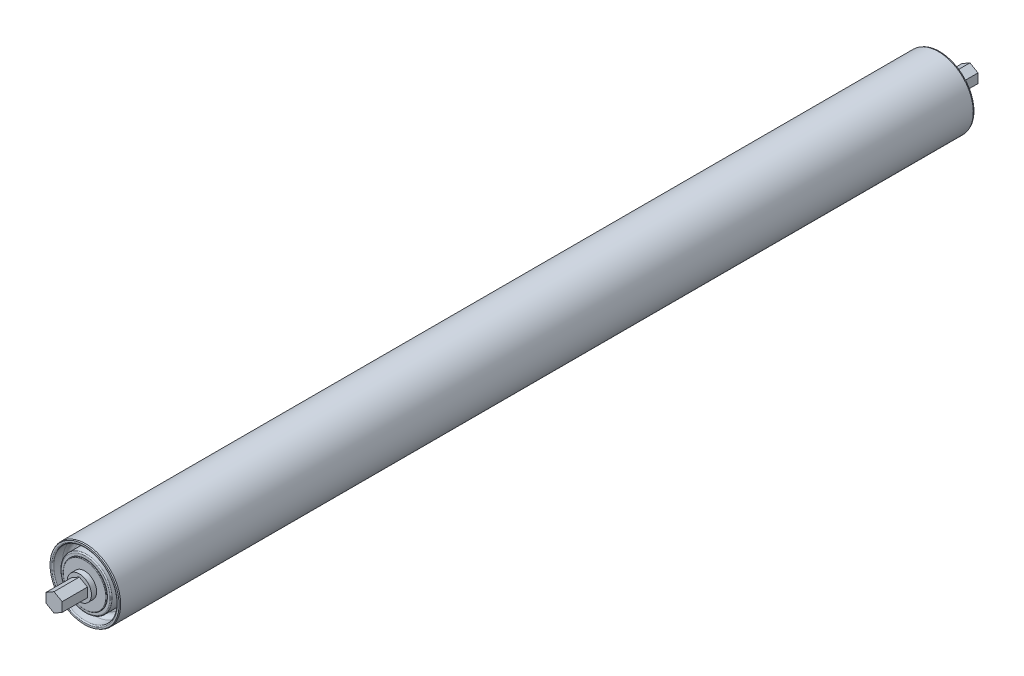
ISO-10303-21;
HEADER;
FILE_DESCRIPTION(('STEP AP214'),'2;1');
FILE_NAME('part.step','',(''),(''),'','','');
FILE_SCHEMA(('AUTOMOTIVE_DESIGN { 1 0 10303 214 1 1 1 1 }'));
ENDSEC;
DATA;
#1=APPLICATION_CONTEXT('core data for automotive mechanical design processes');
#2=APPLICATION_PROTOCOL_DEFINITION('international standard','automotive_design',2000,#1);
#3=PRODUCT_CONTEXT('',#1,'mechanical');
#4=PRODUCT('Part','Part','',(#3));
#5=PRODUCT_RELATED_PRODUCT_CATEGORY('part','',(#4));
#6=PRODUCT_DEFINITION_FORMATION('','',#4);
#7=PRODUCT_DEFINITION_CONTEXT('part definition',#1,'design');
#8=PRODUCT_DEFINITION('design','',#6,#7);
#9=PRODUCT_DEFINITION_SHAPE('','',#8);
#10=(LENGTH_UNIT() NAMED_UNIT(*) SI_UNIT(.MILLI.,.METRE.));
#11=(NAMED_UNIT(*) PLANE_ANGLE_UNIT() SI_UNIT($,.RADIAN.));
#12=(NAMED_UNIT(*) SI_UNIT($,.STERADIAN.) SOLID_ANGLE_UNIT());
#13=UNCERTAINTY_MEASURE_WITH_UNIT(LENGTH_MEASURE(1.E-05),#10,'distance_accuracy_value','');
#14=(GEOMETRIC_REPRESENTATION_CONTEXT(3) GLOBAL_UNCERTAINTY_ASSIGNED_CONTEXT((#13)) GLOBAL_UNIT_ASSIGNED_CONTEXT((#10,
#11,#12)) REPRESENTATION_CONTEXT('',''));
#15=CARTESIAN_POINT('',(0.,0.,0.));
#16=DIRECTION('',(0.,0.,1.));
#17=DIRECTION('',(1.,0.,0.));
#18=AXIS2_PLACEMENT_3D('',#15,#16,#17);
#19=CARTESIAN_POINT('',(0.,23.8125000000001,-294.878125));
#20=DIRECTION('',(0.,0.,1.));
#21=DIRECTION('',(0.,-1.,0.));
#22=AXIS2_PLACEMENT_3D('',#19,#20,#21);
#23=PLANE('',#22);
#24=CARTESIAN_POINT('',(0.,0.,-294.878125));
#25=DIRECTION('',(0.,0.,1.));
#26=DIRECTION('',(0.,-1.,0.));
#27=AXIS2_PLACEMENT_3D('',#24,#25,#26);
#28=CIRCLE('',#27,22.733);
#29=CARTESIAN_POINT('',(0.,-22.733,-294.878125));
#30=VERTEX_POINT('',#29);
#31=EDGE_CURVE('E305',#30,#30,#28,.T.);
#32=ORIENTED_EDGE('',*,*,#31,.T.);
#33=EDGE_LOOP('',(#32));
#34=FACE_BOUND('',#33,.T.);
#35=CARTESIAN_POINT('',(0.,0.,-294.878125));
#36=DIRECTION('',(0.,0.,1.));
#37=DIRECTION('',(0.,-1.,0.));
#38=AXIS2_PLACEMENT_3D('',#35,#36,#37);
#39=CIRCLE('',#38,23.8125);
#40=CARTESIAN_POINT('',(0.,-23.8124999999999,-294.878125));
#41=VERTEX_POINT('',#40);
#42=EDGE_CURVE('E223',#41,#41,#39,.T.);
#43=ORIENTED_EDGE('',*,*,#42,.F.);
#44=EDGE_LOOP('',(#43));
#45=FACE_BOUND('',#44,.T.);
#46=ADVANCED_FACE('F41',(#34,#45),#23,.F.);
#47=CARTESIAN_POINT('',(0.,0.,-294.878125));
#48=DIRECTION('',(0.,0.,1.));
#49=DIRECTION('',(0.,-1.,0.));
#50=AXIS2_PLACEMENT_3D('',#47,#48,#49);
#51=CONICAL_SURFACE('',#50,23.8125,0.380506377112395);
#52=CARTESIAN_POINT('',(0.,0.,-294.084375));
#53=DIRECTION('',(0.,0.,1.));
#54=DIRECTION('',(0.,-1.,0.));
#55=AXIS2_PLACEMENT_3D('',#52,#53,#54);
#56=CIRCLE('',#55,24.13);
#57=CARTESIAN_POINT('',(0.,-24.1299999999999,-294.084375));
#58=VERTEX_POINT('',#57);
#59=EDGE_CURVE('E220',#58,#58,#56,.T.);
#60=ORIENTED_EDGE('',*,*,#59,.F.);
#61=EDGE_LOOP('',(#60));
#62=FACE_BOUND('',#61,.T.);
#63=ORIENTED_EDGE('',*,*,#42,.T.);
#64=EDGE_LOOP('',(#63));
#65=FACE_BOUND('',#64,.T.);
#66=ADVANCED_FACE('F391',(#62,#65),#51,.T.);
#67=CARTESIAN_POINT('',(0.,0.,315.9125));
#68=DIRECTION('',(0.,0.,1.));
#69=DIRECTION('',(0.,-1.,0.));
#70=AXIS2_PLACEMENT_3D('',#67,#68,#69);
#71=CYLINDRICAL_SURFACE('',#70,24.13);
#72=CARTESIAN_POINT('',(0.,0.,294.084375));
#73=DIRECTION('',(0.,0.,1.));
#74=DIRECTION('',(0.,-1.,0.));
#75=AXIS2_PLACEMENT_3D('',#72,#73,#74);
#76=CIRCLE('',#75,24.13);
#77=CARTESIAN_POINT('',(0.,-24.13,294.084375));
#78=VERTEX_POINT('',#77);
#79=EDGE_CURVE('E217',#78,#78,#76,.T.);
#80=ORIENTED_EDGE('',*,*,#79,.F.);
#81=EDGE_LOOP('',(#80));
#82=FACE_BOUND('',#81,.T.);
#83=ORIENTED_EDGE('',*,*,#59,.T.);
#84=EDGE_LOOP('',(#83));
#85=FACE_BOUND('',#84,.T.);
#86=ADVANCED_FACE('F398',(#82,#85),#71,.T.);
#87=CARTESIAN_POINT('',(0.,0.,294.084375));
#88=DIRECTION('',(0.,0.,-1.));
#89=DIRECTION('',(0.,1.,0.));
#90=AXIS2_PLACEMENT_3D('',#87,#88,#89);
#91=CONICAL_SURFACE('',#90,24.13,0.380506377112371);
#92=CARTESIAN_POINT('',(0.,0.,294.878125));
#93=DIRECTION('',(0.,0.,1.));
#94=DIRECTION('',(0.,-1.,0.));
#95=AXIS2_PLACEMENT_3D('',#92,#93,#94);
#96=CIRCLE('',#95,23.8125);
#97=CARTESIAN_POINT('',(0.,-23.8125,294.878125));
#98=VERTEX_POINT('',#97);
#99=EDGE_CURVE('E214',#98,#98,#96,.T.);
#100=ORIENTED_EDGE('',*,*,#99,.F.);
#101=EDGE_LOOP('',(#100));
#102=FACE_BOUND('',#101,.T.);
#103=ORIENTED_EDGE('',*,*,#79,.T.);
#104=EDGE_LOOP('',(#103));
#105=FACE_BOUND('',#104,.T.);
#106=ADVANCED_FACE('F475',(#102,#105),#91,.T.);
#107=CARTESIAN_POINT('',(0.,23.8125,294.878125));
#108=DIRECTION('',(0.,0.,-1.));
#109=DIRECTION('',(0.,1.,0.));
#110=AXIS2_PLACEMENT_3D('',#107,#108,#109);
#111=PLANE('',#110);
#112=CARTESIAN_POINT('',(0.,0.,294.878125));
#113=DIRECTION('',(0.,0.,1.));
#114=DIRECTION('',(0.,-1.,0.));
#115=AXIS2_PLACEMENT_3D('',#112,#113,#114);
#116=CIRCLE('',#115,22.733);
#117=CARTESIAN_POINT('',(0.,-22.733,294.878125));
#118=VERTEX_POINT('',#117);
#119=EDGE_CURVE('E140',#118,#118,#116,.T.);
#120=ORIENTED_EDGE('',*,*,#119,.F.);
#121=EDGE_LOOP('',(#120));
#122=FACE_BOUND('',#121,.T.);
#123=ORIENTED_EDGE('',*,*,#99,.T.);
#124=EDGE_LOOP('',(#123));
#125=FACE_BOUND('',#124,.T.);
#126=ADVANCED_FACE('F412',(#122,#125),#111,.F.);
#127=CARTESIAN_POINT('',(0.,0.,294.116125));
#128=DIRECTION('',(0.,0.,1.));
#129=DIRECTION('',(0.,-1.,0.));
#130=AXIS2_PLACEMENT_3D('',#127,#128,#129);
#131=TOROIDAL_SURFACE('',#130,22.733,0.761999999999988);
#132=ORIENTED_EDGE('',*,*,#119,.T.);
#133=EDGE_LOOP('',(#132));
#134=FACE_BOUND('',#133,.T.);
#135=CARTESIAN_POINT('',(0.,0.,294.116125));
#136=DIRECTION('',(0.,0.,1.));
#137=DIRECTION('',(0.,-1.,0.));
#138=AXIS2_PLACEMENT_3D('',#135,#136,#137);
#139=CIRCLE('',#138,21.971);
#140=CARTESIAN_POINT('',(0.,-21.971,294.116125));
#141=VERTEX_POINT('',#140);
#142=EDGE_CURVE('E302',#141,#141,#139,.T.);
#143=ORIENTED_EDGE('',*,*,#142,.F.);
#144=EDGE_LOOP('',(#143));
#145=FACE_BOUND('',#144,.T.);
#146=ADVANCED_FACE('F445',(#134,#145),#131,.T.);
#147=CARTESIAN_POINT('',(0.,0.,294.497125));
#148=DIRECTION('',(0.,0.,1.));
#149=DIRECTION('',(0.,-1.,0.));
#150=AXIS2_PLACEMENT_3D('',#147,#148,#149);
#151=TOROIDAL_SURFACE('',#150,14.620875,0.381000000000015);
#152=CARTESIAN_POINT('',(0.,0.,294.497125));
#153=DIRECTION('',(0.,0.,1.));
#154=DIRECTION('',(0.,-1.,0.));
#155=AXIS2_PLACEMENT_3D('',#152,#153,#154);
#156=CIRCLE('',#155,15.001875);
#157=CARTESIAN_POINT('',(0.,-15.001875,294.497125));
#158=VERTEX_POINT('',#157);
#159=EDGE_CURVE('E281',#158,#158,#156,.T.);
#160=ORIENTED_EDGE('',*,*,#159,.T.);
#161=EDGE_LOOP('',(#160));
#162=FACE_BOUND('',#161,.T.);
#163=CARTESIAN_POINT('',(0.,0.,294.878125));
#164=DIRECTION('',(0.,0.,1.));
#165=DIRECTION('',(0.,-1.,0.));
#166=AXIS2_PLACEMENT_3D('',#163,#164,#165);
#167=CIRCLE('',#166,14.620875);
#168=CARTESIAN_POINT('',(0.,-14.620875,294.878125));
#169=VERTEX_POINT('',#168);
#170=EDGE_CURVE('E278',#169,#169,#167,.T.);
#171=ORIENTED_EDGE('',*,*,#170,.F.);
#172=EDGE_LOOP('',(#171));
#173=FACE_BOUND('',#172,.T.);
#174=ADVANCED_FACE('F441',(#162,#173),#151,.T.);
#175=CARTESIAN_POINT('',(0.,0.,315.9125));
#176=DIRECTION('',(0.,0.,1.));
#177=DIRECTION('',(0.,-1.,0.));
#178=AXIS2_PLACEMENT_3D('',#175,#176,#177);
#179=CYLINDRICAL_SURFACE('',#178,15.001875);
#180=CARTESIAN_POINT('',(0.,0.,294.116125));
#181=DIRECTION('',(0.,0.,1.));
#182=DIRECTION('',(0.,-1.,0.));
#183=AXIS2_PLACEMENT_3D('',#180,#181,#182);
#184=CIRCLE('',#183,15.001875);
#185=CARTESIAN_POINT('',(0.,-15.001875,294.116125));
#186=VERTEX_POINT('',#185);
#187=EDGE_CURVE('E284',#186,#186,#184,.T.);
#188=ORIENTED_EDGE('',*,*,#187,.T.);
#189=EDGE_LOOP('',(#188));
#190=FACE_BOUND('',#189,.T.);
#191=ORIENTED_EDGE('',*,*,#159,.F.);
#192=EDGE_LOOP('',(#191));
#193=FACE_BOUND('',#192,.T.);
#194=ADVANCED_FACE('F437',(#190,#193),#179,.T.);
#195=CARTESIAN_POINT('',(0.,15.001875,294.116125));
#196=DIRECTION('',(0.,0.,1.));
#197=DIRECTION('',(0.,-1.,0.));
#198=AXIS2_PLACEMENT_3D('',#195,#196,#197);
#199=PLANE('',#198);
#200=CARTESIAN_POINT('',(0.,0.,294.116125));
#201=DIRECTION('',(0.,0.,1.));
#202=DIRECTION('',(0.,-1.,0.));
#203=AXIS2_PLACEMENT_3D('',#200,#201,#202);
#204=CIRCLE('',#203,16.7401875);
#205=CARTESIAN_POINT('',(0.,-16.7401875,294.116125));
#206=VERTEX_POINT('',#205);
#207=EDGE_CURVE('E287',#206,#206,#204,.T.);
#208=ORIENTED_EDGE('',*,*,#207,.T.);
#209=EDGE_LOOP('',(#208));
#210=FACE_BOUND('',#209,.T.);
#211=ORIENTED_EDGE('',*,*,#187,.F.);
#212=EDGE_LOOP('',(#211));
#213=FACE_BOUND('',#212,.T.);
#214=ADVANCED_FACE('F433',(#210,#213),#199,.T.);
#215=CARTESIAN_POINT('',(0.,0.,293.354125));
#216=DIRECTION('',(0.,0.,1.));
#217=DIRECTION('',(0.,-1.,0.));
#218=AXIS2_PLACEMENT_3D('',#215,#216,#217);
#219=TOROIDAL_SURFACE('',#218,16.7401875,0.762000000000032);
#220=CARTESIAN_POINT('',(0.,0.,293.354125));
#221=DIRECTION('',(0.,0.,1.));
#222=DIRECTION('',(0.,-1.,0.));
#223=AXIS2_PLACEMENT_3D('',#220,#221,#222);
#224=CIRCLE('',#223,17.5021875);
#225=CARTESIAN_POINT('',(0.,-17.5021875,293.354125));
#226=VERTEX_POINT('',#225);
#227=EDGE_CURVE('E290',#226,#226,#224,.T.);
#228=ORIENTED_EDGE('',*,*,#227,.T.);
#229=EDGE_LOOP('',(#228));
#230=FACE_BOUND('',#229,.T.);
#231=ORIENTED_EDGE('',*,*,#207,.F.);
#232=EDGE_LOOP('',(#231));
#233=FACE_BOUND('',#232,.T.);
#234=ADVANCED_FACE('F429',(#230,#233),#219,.T.);
#235=CARTESIAN_POINT('',(0.,0.,315.9125));
#236=DIRECTION('',(0.,0.,1.));
#237=DIRECTION('',(0.,-1.,0.));
#238=AXIS2_PLACEMENT_3D('',#235,#236,#237);
#239=CYLINDRICAL_SURFACE('',#238,17.5021875);
#240=CARTESIAN_POINT('',(0.,0.,284.95625));
#241=DIRECTION('',(0.,0.,1.));
#242=DIRECTION('',(0.,-1.,0.));
#243=AXIS2_PLACEMENT_3D('',#240,#241,#242);
#244=CIRCLE('',#243,17.5021875);
#245=CARTESIAN_POINT('',(0.,-17.5021875,284.95625));
#246=VERTEX_POINT('',#245);
#247=EDGE_CURVE('E293',#246,#246,#244,.T.);
#248=ORIENTED_EDGE('',*,*,#247,.T.);
#249=EDGE_LOOP('',(#248));
#250=FACE_BOUND('',#249,.T.);
#251=ORIENTED_EDGE('',*,*,#227,.F.);
#252=EDGE_LOOP('',(#251));
#253=FACE_BOUND('',#252,.T.);
#254=ADVANCED_FACE('F425',(#250,#253),#239,.T.);
#255=CARTESIAN_POINT('',(0.,17.5021875,284.95625));
#256=DIRECTION('',(0.,0.,1.));
#257=DIRECTION('',(0.,-1.,0.));
#258=AXIS2_PLACEMENT_3D('',#255,#256,#257);
#259=PLANE('',#258);
#260=CARTESIAN_POINT('',(0.,0.,284.95625));
#261=DIRECTION('',(0.,0.,1.));
#262=DIRECTION('',(0.,-1.,0.));
#263=AXIS2_PLACEMENT_3D('',#260,#261,#262);
#264=CIRCLE('',#263,18.923);
#265=CARTESIAN_POINT('',(0.,-18.923,284.95625));
#266=VERTEX_POINT('',#265);
#267=EDGE_CURVE('E296',#266,#266,#264,.T.);
#268=ORIENTED_EDGE('',*,*,#267,.T.);
#269=EDGE_LOOP('',(#268));
#270=FACE_BOUND('',#269,.T.);
#271=ORIENTED_EDGE('',*,*,#247,.F.);
#272=EDGE_LOOP('',(#271));
#273=FACE_BOUND('',#272,.T.);
#274=ADVANCED_FACE('F421',(#270,#273),#259,.T.);
#275=CARTESIAN_POINT('',(0.,0.,288.00425));
#276=DIRECTION('',(0.,0.,1.));
#277=DIRECTION('',(0.,-1.,0.));
#278=AXIS2_PLACEMENT_3D('',#275,#276,#277);
#279=TOROIDAL_SURFACE('',#278,18.923,3.048);
#280=CARTESIAN_POINT('',(0.,0.,288.00425));
#281=DIRECTION('',(0.,0.,1.));
#282=DIRECTION('',(0.,-1.,0.));
#283=AXIS2_PLACEMENT_3D('',#280,#281,#282);
#284=CIRCLE('',#283,21.971);
#285=CARTESIAN_POINT('',(0.,-21.971,288.00425));
#286=VERTEX_POINT('',#285);
#287=EDGE_CURVE('E299',#286,#286,#284,.T.);
#288=ORIENTED_EDGE('',*,*,#287,.T.);
#289=EDGE_LOOP('',(#288));
#290=FACE_BOUND('',#289,.T.);
#291=ORIENTED_EDGE('',*,*,#267,.F.);
#292=EDGE_LOOP('',(#291));
#293=FACE_BOUND('',#292,.T.);
#294=ADVANCED_FACE('F417',(#290,#293),#279,.F.);
#295=CARTESIAN_POINT('',(0.,0.,315.9125));
#296=DIRECTION('',(0.,0.,1.));
#297=DIRECTION('',(0.,-1.,0.));
#298=AXIS2_PLACEMENT_3D('',#295,#296,#297);
#299=CYLINDRICAL_SURFACE('',#298,21.971);
#300=ORIENTED_EDGE('',*,*,#142,.T.);
#301=EDGE_LOOP('',(#300));
#302=FACE_BOUND('',#301,.T.);
#303=ORIENTED_EDGE('',*,*,#287,.F.);
#304=EDGE_LOOP('',(#303));
#305=FACE_BOUND('',#304,.T.);
#306=ADVANCED_FACE('F414',(#302,#305),#299,.F.);
#307=CARTESIAN_POINT('',(0.,0.,315.9125));
#308=DIRECTION('',(0.,0.,-1.));
#309=DIRECTION('',(0.,1.,0.));
#310=AXIS2_PLACEMENT_3D('',#307,#308,#309);
#311=PLANE('',#310);
#312=DIRECTION('',(0.866025403784439,0.5,0.));
#313=VECTOR('',#312,1.);
#314=CARTESIAN_POINT('',(0.,-6.41580486636976,315.9125));
#315=LINE('',#314,#313);
#316=CARTESIAN_POINT('',(0.,-6.41580486636976,315.9125));
#317=VERTEX_POINT('',#316);
#318=CARTESIAN_POINT('',(5.55625,-3.2079024331849,315.9125));
#319=VERTEX_POINT('',#318);
#320=EDGE_CURVE('E160',#317,#319,#315,.T.);
#321=ORIENTED_EDGE('',*,*,#320,.T.);
#322=DIRECTION('',(0.,1.,0.));
#323=VECTOR('',#322,1.);
#324=CARTESIAN_POINT('',(5.55625,-3.2079024331849,315.9125));
#325=LINE('',#324,#323);
#326=CARTESIAN_POINT('',(5.55625,3.20790243318482,315.9125));
#327=VERTEX_POINT('',#326);
#328=EDGE_CURVE('E136',#319,#327,#325,.T.);
#329=ORIENTED_EDGE('',*,*,#328,.T.);
#330=DIRECTION('',(-0.866025403784439,0.5,0.));
#331=VECTOR('',#330,1.);
#332=CARTESIAN_POINT('',(5.55625,3.20790243318482,315.9125));
#333=LINE('',#332,#331);
#334=CARTESIAN_POINT('',(0.,6.41580486636968,315.9125));
#335=VERTEX_POINT('',#334);
#336=EDGE_CURVE('E129',#327,#335,#333,.T.);
#337=ORIENTED_EDGE('',*,*,#336,.T.);
#338=DIRECTION('',(-0.866025403784439,-0.5,0.));
#339=VECTOR('',#338,1.);
#340=CARTESIAN_POINT('',(0.,6.41580486636968,315.9125));
#341=LINE('',#340,#339);
#342=CARTESIAN_POINT('',(-5.55625,3.20790243318482,315.9125));
#343=VERTEX_POINT('',#342);
#344=EDGE_CURVE('E133',#335,#343,#341,.T.);
#345=ORIENTED_EDGE('',*,*,#344,.T.);
#346=DIRECTION('',(0.,-1.,0.));
#347=VECTOR('',#346,1.);
#348=CARTESIAN_POINT('',(-5.55625,3.20790243318482,315.9125));
#349=LINE('',#348,#347);
#350=CARTESIAN_POINT('',(-5.55625,-3.2079024331849,315.9125));
#351=VERTEX_POINT('',#350);
#352=EDGE_CURVE('E153',#343,#351,#349,.T.);
#353=ORIENTED_EDGE('',*,*,#352,.T.);
#354=DIRECTION('',(0.866025403784439,-0.5,0.));
#355=VECTOR('',#354,1.);
#356=CARTESIAN_POINT('',(-5.55625,-3.2079024331849,315.9125));
#357=LINE('',#356,#355);
#358=EDGE_CURVE('E155',#351,#317,#357,.T.);
#359=ORIENTED_EDGE('',*,*,#358,.T.);
#360=EDGE_LOOP('',(#321,#329,#337,#345,#353,#359));
#361=FACE_BOUND('',#360,.T.);
#362=ADVANCED_FACE('F131',(#361),#311,.F.);
#363=CARTESIAN_POINT('',(-5.55625,3.20790243318482,-332.887124136732));
#364=DIRECTION('',(-1.,0.,0.));
#365=DIRECTION('',(0.,-1.,0.));
#366=AXIS2_PLACEMENT_3D('',#363,#364,#365);
#367=PLANE('',#366);
#368=DIRECTION('',(0.,1.,0.));
#369=VECTOR('',#368,1.);
#370=CARTESIAN_POINT('',(-5.55625,8.334375,298.45));
#371=LINE('',#370,#369);
#372=CARTESIAN_POINT('',(-5.55625,-3.2079024331849,298.45));
#373=VERTEX_POINT('',#372);
#374=CARTESIAN_POINT('',(-5.55625,3.20790243318482,298.45));
#375=VERTEX_POINT('',#374);
#376=EDGE_CURVE('E189',#373,#375,#371,.T.);
#377=ORIENTED_EDGE('',*,*,#376,.F.);
#378=DIRECTION('',(0.,0.,1.));
#379=VECTOR('',#378,1.);
#380=CARTESIAN_POINT('',(-5.55625,-3.2079024331849,-332.887124136732));
#381=LINE('',#380,#379);
#382=EDGE_CURVE('E179',#373,#351,#381,.T.);
#383=ORIENTED_EDGE('',*,*,#382,.T.);
#384=ORIENTED_EDGE('',*,*,#352,.F.);
#385=DIRECTION('',(0.,0.,1.));
#386=VECTOR('',#385,1.);
#387=CARTESIAN_POINT('',(-5.55625,3.20790243318482,-332.887124136732));
#388=LINE('',#387,#386);
#389=EDGE_CURVE('E151',#375,#343,#388,.T.);
#390=ORIENTED_EDGE('',*,*,#389,.F.);
#391=EDGE_LOOP('',(#377,#383,#384,#390));
#392=FACE_BOUND('',#391,.T.);
#393=ADVANCED_FACE('F461',(#392),#367,.T.);
#394=CARTESIAN_POINT('',(-5.55625,-3.2079024331849,-332.887124136732));
#395=DIRECTION('',(-0.5,-0.866025403784439,0.));
#396=DIRECTION('',(0.866025403784439,-0.5,0.));
#397=AXIS2_PLACEMENT_3D('',#394,#395,#396);
#398=PLANE('',#397);
#399=DIRECTION('',(-0.866025403784439,0.5,0.));
#400=VECTOR('',#399,1.);
#401=CARTESIAN_POINT('',(-6.38701523733298,-2.72825989977732,298.45));
#402=LINE('',#401,#400);
#403=CARTESIAN_POINT('',(0.,-6.41580486636976,298.45));
#404=VERTEX_POINT('',#403);
#405=EDGE_CURVE('E193',#404,#373,#402,.T.);
#406=ORIENTED_EDGE('',*,*,#405,.F.);
#407=DIRECTION('',(0.,0.,1.));
#408=VECTOR('',#407,1.);
#409=CARTESIAN_POINT('',(0.,-6.41580486636976,-332.887124136732));
#410=LINE('',#409,#408);
#411=EDGE_CURVE('E175',#404,#317,#410,.T.);
#412=ORIENTED_EDGE('',*,*,#411,.T.);
#413=ORIENTED_EDGE('',*,*,#358,.F.);
#414=ORIENTED_EDGE('',*,*,#382,.F.);
#415=EDGE_LOOP('',(#406,#412,#413,#414));
#416=FACE_BOUND('',#415,.T.);
#417=ADVANCED_FACE('F458',(#416),#398,.T.);
#418=CARTESIAN_POINT('',(0.,-6.41580486636976,-332.887124136732));
#419=DIRECTION('',(0.5,-0.866025403784439,0.));
#420=DIRECTION('',(0.866025403784439,0.5,0.));
#421=AXIS2_PLACEMENT_3D('',#418,#419,#420);
#422=PLANE('',#421);
#423=DIRECTION('',(-0.866025403784439,-0.5,0.));
#424=VECTOR('',#423,1.);
#425=CARTESIAN_POINT('',(6.38701523733298,-2.72825989977732,298.45));
#426=LINE('',#425,#424);
#427=CARTESIAN_POINT('',(5.55625,-3.2079024331849,298.45));
#428=VERTEX_POINT('',#427);
#429=EDGE_CURVE('E197',#428,#404,#426,.T.);
#430=ORIENTED_EDGE('',*,*,#429,.F.);
#431=DIRECTION('',(0.,0.,1.));
#432=VECTOR('',#431,1.);
#433=CARTESIAN_POINT('',(5.55625,-3.2079024331849,-332.887124136732));
#434=LINE('',#433,#432);
#435=EDGE_CURVE('E171',#428,#319,#434,.T.);
#436=ORIENTED_EDGE('',*,*,#435,.T.);
#437=ORIENTED_EDGE('',*,*,#320,.F.);
#438=ORIENTED_EDGE('',*,*,#411,.F.);
#439=EDGE_LOOP('',(#430,#436,#437,#438));
#440=FACE_BOUND('',#439,.T.);
#441=ADVANCED_FACE('F455',(#440),#422,.T.);
#442=CARTESIAN_POINT('',(5.55625,-3.2079024331849,-332.887124136732));
#443=DIRECTION('',(1.,0.,0.));
#444=DIRECTION('',(0.,1.,0.));
#445=AXIS2_PLACEMENT_3D('',#442,#443,#444);
#446=PLANE('',#445);
#447=DIRECTION('',(0.,-1.,0.));
#448=VECTOR('',#447,1.);
#449=CARTESIAN_POINT('',(5.55624999999999,8.334375,298.45));
#450=LINE('',#449,#448);
#451=CARTESIAN_POINT('',(5.55625,3.20790243318482,298.45));
#452=VERTEX_POINT('',#451);
#453=EDGE_CURVE('E201',#452,#428,#450,.T.);
#454=ORIENTED_EDGE('',*,*,#453,.F.);
#455=DIRECTION('',(0.,0.,1.));
#456=VECTOR('',#455,1.);
#457=CARTESIAN_POINT('',(5.55625,3.20790243318482,-332.887124136732));
#458=LINE('',#457,#456);
#459=EDGE_CURVE('E167',#452,#327,#458,.T.);
#460=ORIENTED_EDGE('',*,*,#459,.T.);
#461=ORIENTED_EDGE('',*,*,#328,.F.);
#462=ORIENTED_EDGE('',*,*,#435,.F.);
#463=EDGE_LOOP('',(#454,#460,#461,#462));
#464=FACE_BOUND('',#463,.T.);
#465=ADVANCED_FACE('F452',(#464),#446,.T.);
#466=CARTESIAN_POINT('',(5.55625,3.20790243318482,-332.887124136732));
#467=DIRECTION('',(0.5,0.866025403784439,0.));
#468=DIRECTION('',(-0.866025403784439,0.5,0.));
#469=AXIS2_PLACEMENT_3D('',#466,#467,#468);
#470=PLANE('',#469);
#471=DIRECTION('',(0.866025403784439,-0.5,0.));
#472=VECTOR('',#471,1.);
#473=CARTESIAN_POINT('',(-0.830765237332983,6.89544739977726,298.45));
#474=LINE('',#473,#472);
#475=CARTESIAN_POINT('',(0.,6.41580486636968,298.45));
#476=VERTEX_POINT('',#475);
#477=EDGE_CURVE('E145',#476,#452,#474,.T.);
#478=ORIENTED_EDGE('',*,*,#477,.F.);
#479=DIRECTION('',(0.,0.,1.));
#480=VECTOR('',#479,1.);
#481=CARTESIAN_POINT('',(0.,6.41580486636968,-332.887124136732));
#482=LINE('',#481,#480);
#483=EDGE_CURVE('E143',#476,#335,#482,.T.);
#484=ORIENTED_EDGE('',*,*,#483,.T.);
#485=ORIENTED_EDGE('',*,*,#336,.F.);
#486=ORIENTED_EDGE('',*,*,#459,.F.);
#487=EDGE_LOOP('',(#478,#484,#485,#486));
#488=FACE_BOUND('',#487,.T.);
#489=ADVANCED_FACE('F144',(#488),#470,.T.);
#490=CARTESIAN_POINT('',(0.,6.41580486636968,-332.887124136732));
#491=DIRECTION('',(-0.5,0.866025403784439,0.));
#492=DIRECTION('',(-0.866025403784439,-0.5,0.));
#493=AXIS2_PLACEMENT_3D('',#490,#491,#492);
#494=PLANE('',#493);
#495=DIRECTION('',(0.866025403784439,0.5,0.));
#496=VECTOR('',#495,1.);
#497=CARTESIAN_POINT('',(0.830765237332983,6.89544739977726,298.45));
#498=LINE('',#497,#496);
#499=EDGE_CURVE('E64',#375,#476,#498,.T.);
#500=ORIENTED_EDGE('',*,*,#499,.F.);
#501=ORIENTED_EDGE('',*,*,#389,.T.);
#502=ORIENTED_EDGE('',*,*,#344,.F.);
#503=ORIENTED_EDGE('',*,*,#483,.F.);
#504=EDGE_LOOP('',(#500,#501,#502,#503));
#505=FACE_BOUND('',#504,.T.);
#506=ADVANCED_FACE('F149',(#505),#494,.T.);
#507=CARTESIAN_POINT('',(0.,8.334375,298.45));
#508=DIRECTION('',(0.,0.,-1.));
#509=DIRECTION('',(0.,1.,0.));
#510=AXIS2_PLACEMENT_3D('',#507,#508,#509);
#511=PLANE('',#510);
#512=ORIENTED_EDGE('',*,*,#499,.T.);
#513=ORIENTED_EDGE('',*,*,#477,.T.);
#514=ORIENTED_EDGE('',*,*,#453,.T.);
#515=ORIENTED_EDGE('',*,*,#429,.T.);
#516=ORIENTED_EDGE('',*,*,#405,.T.);
#517=ORIENTED_EDGE('',*,*,#376,.T.);
#518=EDGE_LOOP('',(#512,#513,#514,#515,#516,#517));
#519=FACE_BOUND('',#518,.T.);
#520=CARTESIAN_POINT('',(0.,0.,298.45));
#521=DIRECTION('',(0.,0.,1.));
#522=DIRECTION('',(0.,-1.,0.));
#523=AXIS2_PLACEMENT_3D('',#520,#521,#522);
#524=CIRCLE('',#523,8.334375);
#525=CARTESIAN_POINT('',(0.,-8.334375,298.45));
#526=VERTEX_POINT('',#525);
#527=EDGE_CURVE('E208',#526,#526,#524,.T.);
#528=ORIENTED_EDGE('',*,*,#527,.T.);
#529=EDGE_LOOP('',(#528));
#530=FACE_BOUND('',#529,.T.);
#531=ADVANCED_FACE('F468',(#519,#530),#511,.F.);
#532=CARTESIAN_POINT('',(0.,0.,315.9125));
#533=DIRECTION('',(0.,0.,1.));
#534=DIRECTION('',(0.,-1.,0.));
#535=AXIS2_PLACEMENT_3D('',#532,#533,#534);
#536=CYLINDRICAL_SURFACE('',#535,8.334375);
#537=ORIENTED_EDGE('',*,*,#527,.F.);
#538=EDGE_LOOP('',(#537));
#539=FACE_BOUND('',#538,.T.);
#540=CARTESIAN_POINT('',(0.,0.,294.878125));
#541=DIRECTION('',(0.,0.,1.));
#542=DIRECTION('',(0.,-1.,0.));
#543=AXIS2_PLACEMENT_3D('',#540,#541,#542);
#544=CIRCLE('',#543,8.334375);
#545=CARTESIAN_POINT('',(0.,-8.334375,294.878125));
#546=VERTEX_POINT('',#545);
#547=EDGE_CURVE('E211',#546,#546,#544,.T.);
#548=ORIENTED_EDGE('',*,*,#547,.T.);
#549=EDGE_LOOP('',(#548));
#550=FACE_BOUND('',#549,.T.);
#551=ADVANCED_FACE('F409',(#539,#550),#536,.T.);
#552=ORIENTED_EDGE('',*,*,#547,.F.);
#553=EDGE_LOOP('',(#552));
#554=FACE_BOUND('',#553,.T.);
#555=ORIENTED_EDGE('',*,*,#170,.T.);
#556=EDGE_LOOP('',(#555));
#557=FACE_BOUND('',#556,.T.);
#558=ADVANCED_FACE('F405',(#554,#557),#111,.F.);
#559=CARTESIAN_POINT('',(0.,0.,-294.116125));
#560=DIRECTION('',(0.,0.,-1.));
#561=DIRECTION('',(0.,-1.,0.));
#562=AXIS2_PLACEMENT_3D('',#559,#560,#561);
#563=TOROIDAL_SURFACE('',#562,22.733,0.761999999999988);
#564=ORIENTED_EDGE('',*,*,#31,.F.);
#565=EDGE_LOOP('',(#564));
#566=FACE_BOUND('',#565,.T.);
#567=CARTESIAN_POINT('',(0.,0.,-294.116125));
#568=DIRECTION('',(0.,0.,1.));
#569=DIRECTION('',(0.,-1.,0.));
#570=AXIS2_PLACEMENT_3D('',#567,#568,#569);
#571=CIRCLE('',#570,21.971);
#572=CARTESIAN_POINT('',(0.,-21.971,-294.116125));
#573=VERTEX_POINT('',#572);
#574=EDGE_CURVE('E332',#573,#573,#571,.T.);
#575=ORIENTED_EDGE('',*,*,#574,.T.);
#576=EDGE_LOOP('',(#575));
#577=FACE_BOUND('',#576,.T.);
#578=ADVANCED_FACE('F336',(#566,#577),#563,.T.);
#579=CARTESIAN_POINT('',(0.,0.,-294.497125));
#580=DIRECTION('',(0.,0.,-1.));
#581=DIRECTION('',(0.,-1.,0.));
#582=AXIS2_PLACEMENT_3D('',#579,#580,#581);
#583=TOROIDAL_SURFACE('',#582,14.620875,0.381000000000015);
#584=CARTESIAN_POINT('',(0.,0.,-294.497125));
#585=DIRECTION('',(0.,0.,1.));
#586=DIRECTION('',(0.,-1.,0.));
#587=AXIS2_PLACEMENT_3D('',#584,#585,#586);
#588=CIRCLE('',#587,15.001875);
#589=CARTESIAN_POINT('',(0.,-15.001875,-294.497125));
#590=VERTEX_POINT('',#589);
#591=EDGE_CURVE('E311',#590,#590,#588,.T.);
#592=ORIENTED_EDGE('',*,*,#591,.F.);
#593=EDGE_LOOP('',(#592));
#594=FACE_BOUND('',#593,.T.);
#595=CARTESIAN_POINT('',(0.,0.,-294.878125));
#596=DIRECTION('',(0.,0.,1.));
#597=DIRECTION('',(0.,-1.,0.));
#598=AXIS2_PLACEMENT_3D('',#595,#596,#597);
#599=CIRCLE('',#598,14.620875);
#600=CARTESIAN_POINT('',(0.,-14.620875,-294.878125));
#601=VERTEX_POINT('',#600);
#602=EDGE_CURVE('E308',#601,#601,#599,.T.);
#603=ORIENTED_EDGE('',*,*,#602,.T.);
#604=EDGE_LOOP('',(#603));
#605=FACE_BOUND('',#604,.T.);
#606=ADVANCED_FACE('F377',(#594,#605),#583,.T.);
#607=CARTESIAN_POINT('',(0.,0.,-315.9125));
#608=DIRECTION('',(0.,0.,-1.));
#609=DIRECTION('',(0.,-1.,0.));
#610=AXIS2_PLACEMENT_3D('',#607,#608,#609);
#611=CYLINDRICAL_SURFACE('',#610,15.001875);
#612=CARTESIAN_POINT('',(0.,0.,-294.116125));
#613=DIRECTION('',(0.,0.,1.));
#614=DIRECTION('',(0.,-1.,0.));
#615=AXIS2_PLACEMENT_3D('',#612,#613,#614);
#616=CIRCLE('',#615,15.001875);
#617=CARTESIAN_POINT('',(0.,-15.001875,-294.116125));
#618=VERTEX_POINT('',#617);
#619=EDGE_CURVE('E314',#618,#618,#616,.T.);
#620=ORIENTED_EDGE('',*,*,#619,.F.);
#621=EDGE_LOOP('',(#620));
#622=FACE_BOUND('',#621,.T.);
#623=ORIENTED_EDGE('',*,*,#591,.T.);
#624=EDGE_LOOP('',(#623));
#625=FACE_BOUND('',#624,.T.);
#626=ADVANCED_FACE('F371',(#622,#625),#611,.T.);
#627=CARTESIAN_POINT('',(0.,15.001875,-294.116125));
#628=DIRECTION('',(0.,0.,-1.));
#629=DIRECTION('',(0.,-1.,0.));
#630=AXIS2_PLACEMENT_3D('',#627,#628,#629);
#631=PLANE('',#630);
#632=CARTESIAN_POINT('',(0.,0.,-294.116125));
#633=DIRECTION('',(0.,0.,1.));
#634=DIRECTION('',(0.,-1.,0.));
#635=AXIS2_PLACEMENT_3D('',#632,#633,#634);
#636=CIRCLE('',#635,16.7401875);
#637=CARTESIAN_POINT('',(0.,-16.7401875,-294.116125));
#638=VERTEX_POINT('',#637);
#639=EDGE_CURVE('E317',#638,#638,#636,.T.);
#640=ORIENTED_EDGE('',*,*,#639,.F.);
#641=EDGE_LOOP('',(#640));
#642=FACE_BOUND('',#641,.T.);
#643=ORIENTED_EDGE('',*,*,#619,.T.);
#644=EDGE_LOOP('',(#643));
#645=FACE_BOUND('',#644,.T.);
#646=ADVANCED_FACE('F365',(#642,#645),#631,.T.);
#647=CARTESIAN_POINT('',(0.,0.,-293.354125));
#648=DIRECTION('',(0.,0.,-1.));
#649=DIRECTION('',(0.,-1.,0.));
#650=AXIS2_PLACEMENT_3D('',#647,#648,#649);
#651=TOROIDAL_SURFACE('',#650,16.7401875,0.762000000000032);
#652=CARTESIAN_POINT('',(0.,0.,-293.354125));
#653=DIRECTION('',(0.,0.,1.));
#654=DIRECTION('',(0.,-1.,0.));
#655=AXIS2_PLACEMENT_3D('',#652,#653,#654);
#656=CIRCLE('',#655,17.5021875);
#657=CARTESIAN_POINT('',(0.,-17.5021875,-293.354125));
#658=VERTEX_POINT('',#657);
#659=EDGE_CURVE('E320',#658,#658,#656,.T.);
#660=ORIENTED_EDGE('',*,*,#659,.F.);
#661=EDGE_LOOP('',(#660));
#662=FACE_BOUND('',#661,.T.);
#663=ORIENTED_EDGE('',*,*,#639,.T.);
#664=EDGE_LOOP('',(#663));
#665=FACE_BOUND('',#664,.T.);
#666=ADVANCED_FACE('F359',(#662,#665),#651,.T.);
#667=CARTESIAN_POINT('',(0.,0.,-315.9125));
#668=DIRECTION('',(0.,0.,-1.));
#669=DIRECTION('',(0.,-1.,0.));
#670=AXIS2_PLACEMENT_3D('',#667,#668,#669);
#671=CYLINDRICAL_SURFACE('',#670,17.5021875);
#672=CARTESIAN_POINT('',(0.,0.,-284.95625));
#673=DIRECTION('',(0.,0.,1.));
#674=DIRECTION('',(0.,-1.,0.));
#675=AXIS2_PLACEMENT_3D('',#672,#673,#674);
#676=CIRCLE('',#675,17.5021875);
#677=CARTESIAN_POINT('',(0.,-17.5021875,-284.95625));
#678=VERTEX_POINT('',#677);
#679=EDGE_CURVE('E323',#678,#678,#676,.T.);
#680=ORIENTED_EDGE('',*,*,#679,.F.);
#681=EDGE_LOOP('',(#680));
#682=FACE_BOUND('',#681,.T.);
#683=ORIENTED_EDGE('',*,*,#659,.T.);
#684=EDGE_LOOP('',(#683));
#685=FACE_BOUND('',#684,.T.);
#686=ADVANCED_FACE('F353',(#682,#685),#671,.T.);
#687=CARTESIAN_POINT('',(0.,17.5021875,-284.95625));
#688=DIRECTION('',(0.,0.,-1.));
#689=DIRECTION('',(0.,-1.,0.));
#690=AXIS2_PLACEMENT_3D('',#687,#688,#689);
#691=PLANE('',#690);
#692=CARTESIAN_POINT('',(0.,0.,-284.95625));
#693=DIRECTION('',(0.,0.,1.));
#694=DIRECTION('',(0.,-1.,0.));
#695=AXIS2_PLACEMENT_3D('',#692,#693,#694);
#696=CIRCLE('',#695,18.923);
#697=CARTESIAN_POINT('',(0.,-18.923,-284.95625));
#698=VERTEX_POINT('',#697);
#699=EDGE_CURVE('E326',#698,#698,#696,.T.);
#700=ORIENTED_EDGE('',*,*,#699,.F.);
#701=EDGE_LOOP('',(#700));
#702=FACE_BOUND('',#701,.T.);
#703=ORIENTED_EDGE('',*,*,#679,.T.);
#704=EDGE_LOOP('',(#703));
#705=FACE_BOUND('',#704,.T.);
#706=ADVANCED_FACE('F347',(#702,#705),#691,.T.);
#707=CARTESIAN_POINT('',(0.,0.,-288.00425));
#708=DIRECTION('',(0.,0.,-1.));
#709=DIRECTION('',(0.,-1.,0.));
#710=AXIS2_PLACEMENT_3D('',#707,#708,#709);
#711=TOROIDAL_SURFACE('',#710,18.923,3.048);
#712=CARTESIAN_POINT('',(0.,0.,-288.00425));
#713=DIRECTION('',(0.,0.,1.));
#714=DIRECTION('',(0.,-1.,0.));
#715=AXIS2_PLACEMENT_3D('',#712,#713,#714);
#716=CIRCLE('',#715,21.971);
#717=CARTESIAN_POINT('',(0.,-21.971,-288.00425));
#718=VERTEX_POINT('',#717);
#719=EDGE_CURVE('E329',#718,#718,#716,.T.);
#720=ORIENTED_EDGE('',*,*,#719,.F.);
#721=EDGE_LOOP('',(#720));
#722=FACE_BOUND('',#721,.T.);
#723=ORIENTED_EDGE('',*,*,#699,.T.);
#724=EDGE_LOOP('',(#723));
#725=FACE_BOUND('',#724,.T.);
#726=ADVANCED_FACE('F341',(#722,#725),#711,.F.);
#727=CARTESIAN_POINT('',(0.,0.,-315.9125));
#728=DIRECTION('',(0.,0.,-1.));
#729=DIRECTION('',(0.,-1.,0.));
#730=AXIS2_PLACEMENT_3D('',#727,#728,#729);
#731=CYLINDRICAL_SURFACE('',#730,21.971);
#732=ORIENTED_EDGE('',*,*,#574,.F.);
#733=EDGE_LOOP('',(#732));
#734=FACE_BOUND('',#733,.T.);
#735=ORIENTED_EDGE('',*,*,#719,.T.);
#736=EDGE_LOOP('',(#735));
#737=FACE_BOUND('',#736,.T.);
#738=ADVANCED_FACE('F338',(#734,#737),#731,.F.);
#739=CARTESIAN_POINT('',(0.,0.,-315.9125));
#740=DIRECTION('',(0.,0.,1.));
#741=DIRECTION('',(0.,-1.,0.));
#742=AXIS2_PLACEMENT_3D('',#739,#740,#741);
#743=PLANE('',#742);
#744=DIRECTION('',(0.866025403784439,-0.5,0.));
#745=VECTOR('',#744,1.);
#746=CARTESIAN_POINT('',(5.55625,3.20790243318482,-315.9125));
#747=LINE('',#746,#745);
#748=CARTESIAN_POINT('',(0.,6.41580486636968,-315.9125));
#749=VERTEX_POINT('',#748);
#750=CARTESIAN_POINT('',(5.55625,3.20790243318482,-315.9125));
#751=VERTEX_POINT('',#750);
#752=EDGE_CURVE('E186',#749,#751,#747,.T.);
#753=ORIENTED_EDGE('',*,*,#752,.T.);
#754=DIRECTION('',(0.,-1.,0.));
#755=VECTOR('',#754,1.);
#756=CARTESIAN_POINT('',(5.55625,-3.2079024331849,-315.9125));
#757=LINE('',#756,#755);
#758=CARTESIAN_POINT('',(5.55625,-3.2079024331849,-315.9125));
#759=VERTEX_POINT('',#758);
#760=EDGE_CURVE('E259',#751,#759,#757,.T.);
#761=ORIENTED_EDGE('',*,*,#760,.T.);
#762=DIRECTION('',(-0.866025403784439,-0.5,0.));
#763=VECTOR('',#762,1.);
#764=CARTESIAN_POINT('',(0.,-6.41580486636976,-315.9125));
#765=LINE('',#764,#763);
#766=CARTESIAN_POINT('',(0.,-6.41580486636975,-315.9125));
#767=VERTEX_POINT('',#766);
#768=EDGE_CURVE('E256',#759,#767,#765,.T.);
#769=ORIENTED_EDGE('',*,*,#768,.T.);
#770=DIRECTION('',(-0.866025403784439,0.5,0.));
#771=VECTOR('',#770,1.);
#772=CARTESIAN_POINT('',(-5.55625,-3.2079024331849,-315.9125));
#773=LINE('',#772,#771);
#774=CARTESIAN_POINT('',(-5.55625,-3.2079024331849,-315.9125));
#775=VERTEX_POINT('',#774);
#776=EDGE_CURVE('E252',#767,#775,#773,.T.);
#777=ORIENTED_EDGE('',*,*,#776,.T.);
#778=DIRECTION('',(0.,1.,0.));
#779=VECTOR('',#778,1.);
#780=CARTESIAN_POINT('',(-5.55625,3.20790243318482,-315.9125));
#781=LINE('',#780,#779);
#782=CARTESIAN_POINT('',(-5.55625,3.20790243318482,-315.9125));
#783=VERTEX_POINT('',#782);
#784=EDGE_CURVE('E166',#775,#783,#781,.T.);
#785=ORIENTED_EDGE('',*,*,#784,.T.);
#786=DIRECTION('',(0.866025403784439,0.5,0.));
#787=VECTOR('',#786,1.);
#788=CARTESIAN_POINT('',(0.,6.41580486636967,-315.9125));
#789=LINE('',#788,#787);
#790=EDGE_CURVE('E183',#783,#749,#789,.T.);
#791=ORIENTED_EDGE('',*,*,#790,.T.);
#792=EDGE_LOOP('',(#753,#761,#769,#777,#785,#791));
#793=FACE_BOUND('',#792,.T.);
#794=ADVANCED_FACE('F43',(#793),#743,.F.);
#795=CARTESIAN_POINT('',(-5.55625,-3.2079024331849,-298.45));
#796=VERTEX_POINT('',#795);
#797=EDGE_CURVE('E176',#775,#796,#381,.T.);
#798=ORIENTED_EDGE('',*,*,#797,.T.);
#799=DIRECTION('',(0.,-1.,0.));
#800=VECTOR('',#799,1.);
#801=CARTESIAN_POINT('',(-5.55625,8.33437500000007,-298.45));
#802=LINE('',#801,#800);
#803=CARTESIAN_POINT('',(-5.55625,3.20790243318482,-298.45));
#804=VERTEX_POINT('',#803);
#805=EDGE_CURVE('E191',#804,#796,#802,.T.);
#806=ORIENTED_EDGE('',*,*,#805,.F.);
#807=EDGE_CURVE('E180',#783,#804,#388,.T.);
#808=ORIENTED_EDGE('',*,*,#807,.F.);
#809=ORIENTED_EDGE('',*,*,#784,.F.);
#810=EDGE_LOOP('',(#798,#806,#808,#809));
#811=FACE_BOUND('',#810,.T.);
#812=ADVANCED_FACE('F274',(#811),#367,.T.);
#813=ORIENTED_EDGE('',*,*,#807,.T.);
#814=DIRECTION('',(-0.866025403784439,-0.5,0.));
#815=VECTOR('',#814,1.);
#816=CARTESIAN_POINT('',(0.830765237333014,6.89544739977727,-298.45));
#817=LINE('',#816,#815);
#818=CARTESIAN_POINT('',(0.,6.41580486636968,-298.45));
#819=VERTEX_POINT('',#818);
#820=EDGE_CURVE('E56',#819,#804,#817,.T.);
#821=ORIENTED_EDGE('',*,*,#820,.F.);
#822=EDGE_CURVE('E147',#749,#819,#482,.T.);
#823=ORIENTED_EDGE('',*,*,#822,.F.);
#824=ORIENTED_EDGE('',*,*,#790,.F.);
#825=EDGE_LOOP('',(#813,#821,#823,#824));
#826=FACE_BOUND('',#825,.T.);
#827=ADVANCED_FACE('F271',(#826),#494,.T.);
#828=ORIENTED_EDGE('',*,*,#822,.T.);
#829=DIRECTION('',(-0.866025403784439,0.5,0.));
#830=VECTOR('',#829,1.);
#831=CARTESIAN_POINT('',(-0.830765237333015,6.89544739977727,-298.45));
#832=LINE('',#831,#830);
#833=CARTESIAN_POINT('',(5.55625,3.20790243318482,-298.45));
#834=VERTEX_POINT('',#833);
#835=EDGE_CURVE('E206',#834,#819,#832,.T.);
#836=ORIENTED_EDGE('',*,*,#835,.F.);
#837=EDGE_CURVE('E163',#751,#834,#458,.T.);
#838=ORIENTED_EDGE('',*,*,#837,.F.);
#839=ORIENTED_EDGE('',*,*,#752,.F.);
#840=EDGE_LOOP('',(#828,#836,#838,#839));
#841=FACE_BOUND('',#840,.T.);
#842=ADVANCED_FACE('F267',(#841),#470,.T.);
#843=ORIENTED_EDGE('',*,*,#837,.T.);
#844=DIRECTION('',(0.,1.,0.));
#845=VECTOR('',#844,1.);
#846=CARTESIAN_POINT('',(5.55624999999999,8.33437500000007,-298.45));
#847=LINE('',#846,#845);
#848=CARTESIAN_POINT('',(5.55625,-3.2079024331849,-298.45));
#849=VERTEX_POINT('',#848);
#850=EDGE_CURVE('E203',#849,#834,#847,.T.);
#851=ORIENTED_EDGE('',*,*,#850,.F.);
#852=EDGE_CURVE('E168',#759,#849,#434,.T.);
#853=ORIENTED_EDGE('',*,*,#852,.F.);
#854=ORIENTED_EDGE('',*,*,#760,.F.);
#855=EDGE_LOOP('',(#843,#851,#853,#854));
#856=FACE_BOUND('',#855,.T.);
#857=ADVANCED_FACE('F269',(#856),#446,.T.);
#858=ORIENTED_EDGE('',*,*,#852,.T.);
#859=DIRECTION('',(0.866025403784439,0.5,0.));
#860=VECTOR('',#859,1.);
#861=CARTESIAN_POINT('',(6.38701523733301,-2.7282598997773,-298.45));
#862=LINE('',#861,#860);
#863=CARTESIAN_POINT('',(0.,-6.41580486636976,-298.45));
#864=VERTEX_POINT('',#863);
#865=EDGE_CURVE('E199',#864,#849,#862,.T.);
#866=ORIENTED_EDGE('',*,*,#865,.F.);
#867=EDGE_CURVE('E172',#767,#864,#410,.T.);
#868=ORIENTED_EDGE('',*,*,#867,.F.);
#869=ORIENTED_EDGE('',*,*,#768,.F.);
#870=EDGE_LOOP('',(#858,#866,#868,#869));
#871=FACE_BOUND('',#870,.T.);
#872=ADVANCED_FACE('F248',(#871),#422,.T.);
#873=ORIENTED_EDGE('',*,*,#867,.T.);
#874=DIRECTION('',(0.866025403784439,-0.5,0.));
#875=VECTOR('',#874,1.);
#876=CARTESIAN_POINT('',(-6.38701523733301,-2.7282598997773,-298.45));
#877=LINE('',#876,#875);
#878=EDGE_CURVE('E195',#796,#864,#877,.T.);
#879=ORIENTED_EDGE('',*,*,#878,.F.);
#880=ORIENTED_EDGE('',*,*,#797,.F.);
#881=ORIENTED_EDGE('',*,*,#776,.F.);
#882=EDGE_LOOP('',(#873,#879,#880,#881));
#883=FACE_BOUND('',#882,.T.);
#884=ADVANCED_FACE('F239',(#883),#398,.T.);
#885=CARTESIAN_POINT('',(0.,8.33437500000007,-298.45));
#886=DIRECTION('',(0.,0.,1.));
#887=DIRECTION('',(0.,-1.,0.));
#888=AXIS2_PLACEMENT_3D('',#885,#886,#887);
#889=PLANE('',#888);
#890=CARTESIAN_POINT('',(0.,0.,-298.45));
#891=DIRECTION('',(0.,0.,1.));
#892=DIRECTION('',(0.,-1.,0.));
#893=AXIS2_PLACEMENT_3D('',#890,#891,#892);
#894=CIRCLE('',#893,8.334375);
#895=CARTESIAN_POINT('',(0.,-8.33437499999992,-298.45));
#896=VERTEX_POINT('',#895);
#897=EDGE_CURVE('E11',#896,#896,#894,.T.);
#898=ORIENTED_EDGE('',*,*,#897,.F.);
#899=EDGE_LOOP('',(#898));
#900=FACE_BOUND('',#899,.T.);
#901=ORIENTED_EDGE('',*,*,#878,.T.);
#902=ORIENTED_EDGE('',*,*,#865,.T.);
#903=ORIENTED_EDGE('',*,*,#850,.T.);
#904=ORIENTED_EDGE('',*,*,#835,.T.);
#905=ORIENTED_EDGE('',*,*,#820,.T.);
#906=ORIENTED_EDGE('',*,*,#805,.T.);
#907=EDGE_LOOP('',(#901,#902,#903,#904,#905,#906));
#908=FACE_BOUND('',#907,.T.);
#909=ADVANCED_FACE('F234',(#900,#908),#889,.F.);
#910=CARTESIAN_POINT('',(0.,0.,315.9125));
#911=DIRECTION('',(0.,0.,1.));
#912=DIRECTION('',(0.,-1.,0.));
#913=AXIS2_PLACEMENT_3D('',#910,#911,#912);
#914=CYLINDRICAL_SURFACE('',#913,8.334375);
#915=CARTESIAN_POINT('',(0.,0.,-294.878125));
#916=DIRECTION('',(0.,0.,1.));
#917=DIRECTION('',(0.,-1.,0.));
#918=AXIS2_PLACEMENT_3D('',#915,#916,#917);
#919=CIRCLE('',#918,8.334375);
#920=CARTESIAN_POINT('',(0.,-8.33437499999992,-294.878125));
#921=VERTEX_POINT('',#920);
#922=EDGE_CURVE('E49',#921,#921,#919,.T.);
#923=ORIENTED_EDGE('',*,*,#922,.F.);
#924=EDGE_LOOP('',(#923));
#925=FACE_BOUND('',#924,.T.);
#926=ORIENTED_EDGE('',*,*,#897,.T.);
#927=EDGE_LOOP('',(#926));
#928=FACE_BOUND('',#927,.T.);
#929=ADVANCED_FACE('F231',(#925,#928),#914,.T.);
#930=ORIENTED_EDGE('',*,*,#922,.T.);
#931=EDGE_LOOP('',(#930));
#932=FACE_BOUND('',#931,.T.);
#933=ORIENTED_EDGE('',*,*,#602,.F.);
#934=EDGE_LOOP('',(#933));
#935=FACE_BOUND('',#934,.T.);
#936=ADVANCED_FACE('F228',(#932,#935),#23,.F.);
#937=CLOSED_SHELL('',(#46,#66,#86,#106,#126,#146,#174,#194,#214,#234,#254,#274,#294,#306,#362,
#393,#417,#441,#465,#489,#506,#531,#551,#558,#578,#606,#626,#646,#666,#686,#706,#726,#738,#794,
#812,#827,#842,#857,#872,#884,#909,#929,#936));
#938=MANIFOLD_SOLID_BREP('B2',#937);
#939=ADVANCED_BREP_SHAPE_REPRESENTATION('',(#18,#938),#14);
#940=SHAPE_DEFINITION_REPRESENTATION(#9,#939);
ENDSEC;
END-ISO-10303-21;
